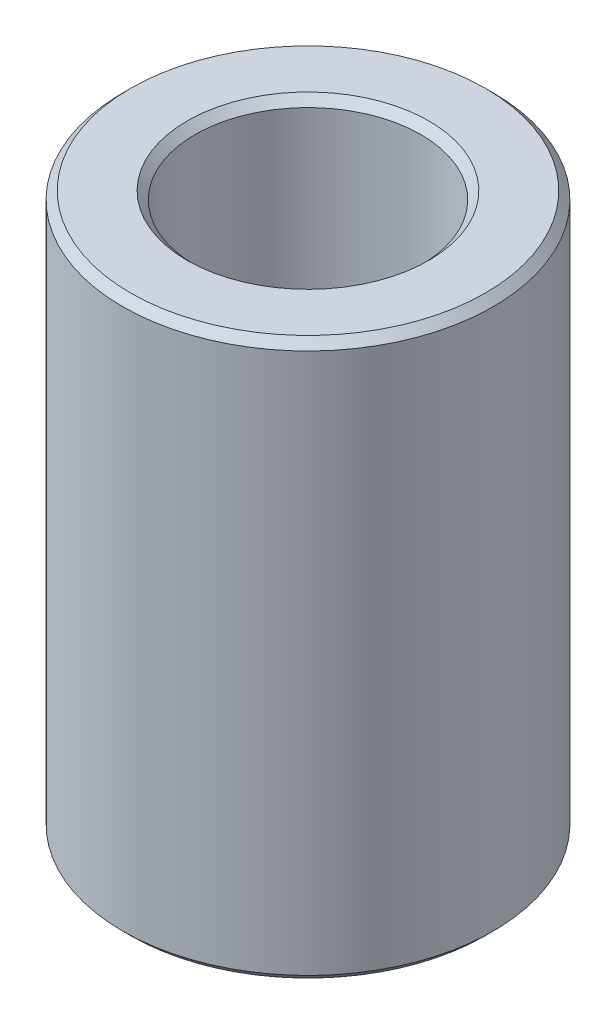
ISO-10303-21;
HEADER;
FILE_DESCRIPTION(('STEP AP214'),'2;1');
FILE_NAME('part.step','',(''),(''),'','','');
FILE_SCHEMA(('AUTOMOTIVE_DESIGN { 1 0 10303 214 1 1 1 1 }'));
ENDSEC;
DATA;
#1=APPLICATION_CONTEXT('core data for automotive mechanical design processes');
#2=APPLICATION_PROTOCOL_DEFINITION('international standard','automotive_design',2000,#1);
#3=PRODUCT_CONTEXT('',#1,'mechanical');
#4=PRODUCT('Part','Part','',(#3));
#5=PRODUCT_RELATED_PRODUCT_CATEGORY('part','',(#4));
#6=PRODUCT_DEFINITION_FORMATION('','',#4);
#7=PRODUCT_DEFINITION_CONTEXT('part definition',#1,'design');
#8=PRODUCT_DEFINITION('design','',#6,#7);
#9=PRODUCT_DEFINITION_SHAPE('','',#8);
#10=(LENGTH_UNIT() NAMED_UNIT(*) SI_UNIT(.MILLI.,.METRE.));
#11=(NAMED_UNIT(*) PLANE_ANGLE_UNIT() SI_UNIT($,.RADIAN.));
#12=(NAMED_UNIT(*) SI_UNIT($,.STERADIAN.) SOLID_ANGLE_UNIT());
#13=UNCERTAINTY_MEASURE_WITH_UNIT(LENGTH_MEASURE(1.E-05),#10,'distance_accuracy_value','');
#14=(GEOMETRIC_REPRESENTATION_CONTEXT(3) GLOBAL_UNCERTAINTY_ASSIGNED_CONTEXT((#13)) GLOBAL_UNIT_ASSIGNED_CONTEXT((#10,
#11,#12)) REPRESENTATION_CONTEXT('',''));
#15=CARTESIAN_POINT('',(0.,0.,0.));
#16=DIRECTION('',(0.,0.,1.));
#17=DIRECTION('',(1.,0.,0.));
#18=AXIS2_PLACEMENT_3D('',#15,#16,#17);
#19=CARTESIAN_POINT('',(0.,127.702674319287,0.));
#20=DIRECTION('',(0.,-1.,0.));
#21=DIRECTION('',(0.,0.,-1.));
#22=AXIS2_PLACEMENT_3D('',#19,#20,#21);
#23=CYLINDRICAL_SURFACE('',#22,42.5);
#24=CARTESIAN_POINT('',(0.,1.81172370269858,0.));
#25=DIRECTION('',(0.,1.,0.));
#26=DIRECTION('',(0.,0.,1.));
#27=AXIS2_PLACEMENT_3D('',#24,#25,#26);
#28=CIRCLE('',#27,42.5);
#29=CARTESIAN_POINT('',(0.,1.81172370269858,42.5));
#30=VERTEX_POINT('',#29);
#31=EDGE_CURVE('E10',#30,#30,#28,.T.);
#32=ORIENTED_EDGE('',*,*,#31,.T.);
#33=EDGE_LOOP('',(#32));
#34=FACE_BOUND('',#33,.T.);
#35=CARTESIAN_POINT('',(0.,125.890950616588,0.));
#36=DIRECTION('',(0.,1.,0.));
#37=DIRECTION('',(0.,0.,1.));
#38=AXIS2_PLACEMENT_3D('',#35,#36,#37);
#39=CIRCLE('',#38,42.5);
#40=CARTESIAN_POINT('',(0.,125.890950616588,42.5));
#41=VERTEX_POINT('',#40);
#42=EDGE_CURVE('E50',#41,#41,#39,.F.);
#43=ORIENTED_EDGE('',*,*,#42,.T.);
#44=EDGE_LOOP('',(#43));
#45=FACE_BOUND('',#44,.T.);
#46=ADVANCED_FACE('F39',(#34,#45),#23,.T.);
#47=CARTESIAN_POINT('',(0.,127.702674319287,0.));
#48=DIRECTION('',(0.,1.,0.));
#49=DIRECTION('',(0.,0.,1.));
#50=AXIS2_PLACEMENT_3D('',#47,#48,#49);
#51=PLANE('',#50);
#52=CARTESIAN_POINT('',(0.,127.702674319287,0.));
#53=DIRECTION('',(0.,1.,0.));
#54=DIRECTION('',(0.,0.,1.));
#55=AXIS2_PLACEMENT_3D('',#52,#53,#54);
#56=CIRCLE('',#55,27.7301246402489);
#57=CARTESIAN_POINT('',(0.,127.702674319287,27.7301246402489));
#58=VERTEX_POINT('',#57);
#59=EDGE_CURVE('E58',#58,#58,#56,.F.);
#60=ORIENTED_EDGE('',*,*,#59,.T.);
#61=EDGE_LOOP('',(#60));
#62=FACE_BOUND('',#61,.T.);
#63=CARTESIAN_POINT('',(0.,127.702674319287,0.));
#64=DIRECTION('',(0.,1.,0.));
#65=DIRECTION('',(0.,0.,1.));
#66=AXIS2_PLACEMENT_3D('',#63,#64,#65);
#67=CIRCLE('',#66,40.6882762973014);
#68=CARTESIAN_POINT('',(0.,127.702674319287,40.6882762973014));
#69=VERTEX_POINT('',#68);
#70=EDGE_CURVE('E61',#69,#69,#67,.T.);
#71=ORIENTED_EDGE('',*,*,#70,.T.);
#72=EDGE_LOOP('',(#71));
#73=FACE_BOUND('',#72,.T.);
#74=ADVANCED_FACE('F88',(#62,#73),#51,.T.);
#75=CARTESIAN_POINT('',(0.,0.,0.));
#76=DIRECTION('',(0.,1.,0.));
#77=DIRECTION('',(0.,0.,1.));
#78=AXIS2_PLACEMENT_3D('',#75,#76,#77);
#79=PLANE('',#78);
#80=CARTESIAN_POINT('',(0.,0.,0.));
#81=DIRECTION('',(0.,1.,0.));
#82=DIRECTION('',(0.,0.,1.));
#83=AXIS2_PLACEMENT_3D('',#80,#81,#82);
#84=CIRCLE('',#83,27.7301246402489);
#85=CARTESIAN_POINT('',(0.,0.,-27.7301246402489));
#86=VERTEX_POINT('',#85);
#87=EDGE_CURVE('E51',#86,#86,#84,.T.);
#88=ORIENTED_EDGE('',*,*,#87,.T.);
#89=EDGE_LOOP('',(#88));
#90=FACE_BOUND('',#89,.T.);
#91=CARTESIAN_POINT('',(0.,0.,0.));
#92=DIRECTION('',(0.,1.,0.));
#93=DIRECTION('',(0.,0.,1.));
#94=AXIS2_PLACEMENT_3D('',#91,#92,#93);
#95=CIRCLE('',#94,40.6882762973014);
#96=CARTESIAN_POINT('',(0.,0.,40.6882762973014));
#97=VERTEX_POINT('',#96);
#98=EDGE_CURVE('E54',#97,#97,#95,.F.);
#99=ORIENTED_EDGE('',*,*,#98,.T.);
#100=EDGE_LOOP('',(#99));
#101=FACE_BOUND('',#100,.T.);
#102=ADVANCED_FACE('F83',(#90,#101),#79,.F.);
#103=CARTESIAN_POINT('',(0.,127.702674319287,0.));
#104=DIRECTION('',(0.,-1.,0.));
#105=DIRECTION('',(0.,0.,-1.));
#106=AXIS2_PLACEMENT_3D('',#103,#104,#105);
#107=CYLINDRICAL_SURFACE('',#106,25.9184009375503);
#108=CARTESIAN_POINT('',(0.,125.890950616588,0.));
#109=DIRECTION('',(0.,1.,0.));
#110=DIRECTION('',(0.,0.,1.));
#111=AXIS2_PLACEMENT_3D('',#108,#109,#110);
#112=CIRCLE('',#111,25.9184009375503);
#113=CARTESIAN_POINT('',(0.,125.890950616588,-25.9184009375503));
#114=VERTEX_POINT('',#113);
#115=EDGE_CURVE('E67',#114,#114,#112,.T.);
#116=CARTESIAN_POINT('',(0.,1.81172370269861,0.));
#117=DIRECTION('',(0.,1.,0.));
#118=DIRECTION('',(0.,0.,1.));
#119=AXIS2_PLACEMENT_3D('',#116,#117,#118);
#120=CIRCLE('',#119,25.9184009375503);
#121=CARTESIAN_POINT('',(0.,1.81172370269858,-25.9184009375503));
#122=VERTEX_POINT('',#121);
#123=EDGE_CURVE('E69',#122,#122,#120,.F.);
#124=CARTESIAN_POINT('',(0.,125.890950616588,-25.9184009375503));
#125=CARTESIAN_POINT('',(0.,124.598458669569,-25.9184009375503));
#126=CARTESIAN_POINT('',(0.,123.305966722549,-25.9184009375503));
#127=CARTESIAN_POINT('',(0.,120.72098282851,-25.9184009375503));
#128=CARTESIAN_POINT('',(0.,119.42849088149,-25.9184009375503));
#129=CARTESIAN_POINT('',(0.,116.843506987451,-25.9184009375503));
#130=CARTESIAN_POINT('',(0.,115.551015040431,-25.9184009375503));
#131=CARTESIAN_POINT('',(0.,112.966031146392,-25.9184009375503));
#132=CARTESIAN_POINT('',(0.,111.673539199372,-25.9184009375503));
#133=CARTESIAN_POINT('',(0.,109.088555305333,-25.9184009375503));
#134=CARTESIAN_POINT('',(0.,107.796063358313,-25.9184009375503));
#135=CARTESIAN_POINT('',(0.,105.211079464273,-25.9184009375503));
#136=CARTESIAN_POINT('',(0.,103.918587517254,-25.9184009375503));
#137=CARTESIAN_POINT('',(0.,101.333603623214,-25.9184009375503));
#138=CARTESIAN_POINT('',(0.,100.041111676195,-25.9184009375503));
#139=CARTESIAN_POINT('',(0.,97.4561277821553,-25.9184009375503));
#140=CARTESIAN_POINT('',(0.,96.1636358351356,-25.9184009375503));
#141=CARTESIAN_POINT('',(0.,93.5786519410963,-25.9184009375503));
#142=CARTESIAN_POINT('',(0.,92.2861599940766,-25.9184009375503));
#143=CARTESIAN_POINT('',(0.,89.7011761000372,-25.9184009375503));
#144=CARTESIAN_POINT('',(0.,88.4086841530175,-25.9184009375503));
#145=CARTESIAN_POINT('',(0.,85.8237002589781,-25.9184009375503));
#146=CARTESIAN_POINT('',(0.,84.5312083119585,-25.9184009375503));
#147=CARTESIAN_POINT('',(0.,81.9462244179191,-25.9184009375503));
#148=CARTESIAN_POINT('',(0.,80.6537324708994,-25.9184009375503));
#149=CARTESIAN_POINT('',(0.,78.06874857686,-25.9184009375503));
#150=CARTESIAN_POINT('',(0.,76.7762566298403,-25.9184009375503));
#151=CARTESIAN_POINT('',(0.,74.191272735801,-25.9184009375503));
#152=CARTESIAN_POINT('',(0.,72.8987807887813,-25.9184009375503));
#153=CARTESIAN_POINT('',(0.,70.3137968947419,-25.9184009375503));
#154=CARTESIAN_POINT('',(0.,69.0213049477222,-25.9184009375503));
#155=CARTESIAN_POINT('',(0.,66.4363210536829,-25.9184009375503));
#156=CARTESIAN_POINT('',(0.,65.1438291066632,-25.9184009375503));
#157=CARTESIAN_POINT('',(0.,62.5588452126238,-25.9184009375503));
#158=CARTESIAN_POINT('',(0.,61.2663532656041,-25.9184009375503));
#159=CARTESIAN_POINT('',(0.,58.6813693715648,-25.9184009375503));
#160=CARTESIAN_POINT('',(0.,57.3888774245451,-25.9184009375503));
#161=CARTESIAN_POINT('',(0.,54.8038935305057,-25.9184009375503));
#162=CARTESIAN_POINT('',(0.,53.511401583486,-25.9184009375503));
#163=CARTESIAN_POINT('',(0.,50.9264176894466,-25.9184009375503));
#164=CARTESIAN_POINT('',(0.,49.633925742427,-25.9184009375503));
#165=CARTESIAN_POINT('',(0.,47.0489418483876,-25.9184009375503));
#166=CARTESIAN_POINT('',(0.,45.7564499013679,-25.9184009375503));
#167=CARTESIAN_POINT('',(0.,43.1714660073285,-25.9184009375503));
#168=CARTESIAN_POINT('',(0.,41.8789740603088,-25.9184009375503));
#169=CARTESIAN_POINT('',(0.,39.2939901662695,-25.9184009375503));
#170=CARTESIAN_POINT('',(0.,38.0014982192498,-25.9184009375503));
#171=CARTESIAN_POINT('',(0.,35.4165143252104,-25.9184009375503));
#172=CARTESIAN_POINT('',(0.,34.1240223781907,-25.9184009375503));
#173=CARTESIAN_POINT('',(0.,31.5390384841514,-25.9184009375503));
#174=CARTESIAN_POINT('',(0.,30.2465465371317,-25.9184009375503));
#175=CARTESIAN_POINT('',(0.,27.6615626430923,-25.9184009375503));
#176=CARTESIAN_POINT('',(0.,26.3690706960726,-25.9184009375503));
#177=CARTESIAN_POINT('',(0.,23.7840868020332,-25.9184009375503));
#178=CARTESIAN_POINT('',(0.,22.4915948550136,-25.9184009375503));
#179=CARTESIAN_POINT('',(0.,19.9066109609742,-25.9184009375503));
#180=CARTESIAN_POINT('',(0.,18.6141190139545,-25.9184009375503));
#181=CARTESIAN_POINT('',(0.,16.0291351199151,-25.9184009375503));
#182=CARTESIAN_POINT('',(0.,14.7366431728954,-25.9184009375503));
#183=CARTESIAN_POINT('',(0.,12.1516592788561,-25.9184009375503));
#184=CARTESIAN_POINT('',(0.,10.8591673318364,-25.9184009375503));
#185=CARTESIAN_POINT('',(0.,8.27418343779701,-25.9184009375503));
#186=CARTESIAN_POINT('',(0.,6.98169149077733,-25.9184009375503));
#187=CARTESIAN_POINT('',(0.,4.39670759673795,-25.9184009375503));
#188=CARTESIAN_POINT('',(0.,3.10421564971827,-25.9184009375503));
#189=CARTESIAN_POINT('',(0.,1.81172370269858,-25.9184009375503));
#190=B_SPLINE_CURVE_WITH_KNOTS('',3,(#124,#125,#126,#127,#128,#129,#130,#131,#132,#133,#134,
#135,#136,#137,#138,#139,#140,#141,#142,#143,#144,#145,#146,#147,#148,#149,#150,#151,#152,#153,
#154,#155,#156,#157,#158,#159,#160,#161,#162,#163,#164,#165,#166,#167,#168,#169,#170,#171,#172,
#173,#174,#175,#176,#177,#178,#179,#180,#181,#182,#183,#184,#185,#186,#187,#188,#189),
.UNSPECIFIED.,.F.,.F.,(4,2,2,2,2,2,2,2,2,2,2,2,2,2,2,2,2,2,2,2,2,2,2,2,2,2,2,2,2,2,2,2,4),(0.,
3.87747584105905,7.75495168211809,11.6324275231772,15.5099033642362,19.3873792052953,
23.2648550463543,27.1423308874134,31.0198067284724,34.8972825695315,38.7747584105906,
42.6522342516496,46.5297100927087,50.4071859337677,54.2846617748268,58.1621376158858,
62.0396134569449,65.917089298004,69.794565139063,73.6720409801221,77.5495168211811,
81.4269926622402,85.3044685032992,89.1819443443583,93.0594201854174,96.9368960264764,
100.814371867535,104.691847708595,108.569323549654,112.446799390713,116.324275231772,
120.201751072831,124.07922691389),.UNSPECIFIED.);
#191=EDGE_CURVE('BSEAM71',#114,#122,#190,.T.);
#192=ORIENTED_EDGE('',*,*,#115,.T.);
#193=ORIENTED_EDGE('',*,*,#123,.T.);
#194=ORIENTED_EDGE('',*,*,#191,.T.);
#195=ORIENTED_EDGE('',*,*,#191,.F.);
#196=EDGE_LOOP('',(#192,#194,#193,#195));
#197=FACE_BOUND('',#196,.T.);
#198=ADVANCED_FACE('F71',(#197),#107,.F.);
#199=CARTESIAN_POINT('',(0.,125.890950616588,0.));
#200=DIRECTION('',(0.,1.,0.));
#201=DIRECTION('',(0.,0.,1.));
#202=AXIS2_PLACEMENT_3D('',#199,#200,#201);
#203=CONICAL_SURFACE('',#202,25.9184009375503,0.785398163397446);
#204=ORIENTED_EDGE('',*,*,#59,.F.);
#205=EDGE_LOOP('',(#204));
#206=FACE_BOUND('',#205,.T.);
#207=ORIENTED_EDGE('',*,*,#115,.F.);
#208=EDGE_LOOP('',(#207));
#209=FACE_BOUND('',#208,.T.);
#210=ADVANCED_FACE('F77',(#206,#209),#203,.F.);
#211=CARTESIAN_POINT('',(0.,0.,0.));
#212=DIRECTION('',(0.,-1.,0.));
#213=DIRECTION('',(0.,0.,-1.));
#214=AXIS2_PLACEMENT_3D('',#211,#212,#213);
#215=CONICAL_SURFACE('',#214,27.7301246402489,0.785398163397443);
#216=CARTESIAN_POINT('',(0.,1.81172370269861,-25.9184009375503));
#217=CARTESIAN_POINT('',(0.,1.7928515807955,-25.9372730594534));
#218=CARTESIAN_POINT('',(0.,1.77397945889239,-25.9561451813566));
#219=CARTESIAN_POINT('',(0.,1.73623521508617,-25.9938894251628));
#220=CARTESIAN_POINT('',(0.,1.71736309318306,-26.0127615470659));
#221=CARTESIAN_POINT('',(0.,1.67961884937684,-26.0505057908721));
#222=CARTESIAN_POINT('',(0.,1.66074672747372,-26.0693779127752));
#223=CARTESIAN_POINT('',(0.,1.6230024836675,-26.1071221565814));
#224=CARTESIAN_POINT('',(0.,1.60413036176439,-26.1259942784845));
#225=CARTESIAN_POINT('',(0.,1.56638611795817,-26.1637385222908));
#226=CARTESIAN_POINT('',(0.,1.54751399605506,-26.1826106441939));
#227=CARTESIAN_POINT('',(0.,1.50976975224884,-26.2203548880001));
#228=CARTESIAN_POINT('',(0.,1.49089763034573,-26.2392270099032));
#229=CARTESIAN_POINT('',(0.,1.45315338653951,-26.2769712537094));
#230=CARTESIAN_POINT('',(0.,1.4342812646364,-26.2958433756125));
#231=CARTESIAN_POINT('',(0.,1.39653702083018,-26.3335876194188));
#232=CARTESIAN_POINT('',(0.,1.37766489892707,-26.3524597413219));
#233=CARTESIAN_POINT('',(0.,1.33992065512085,-26.3902039851281));
#234=CARTESIAN_POINT('',(0.,1.32104853321774,-26.4090761070312));
#235=CARTESIAN_POINT('',(0.,1.28330428941151,-26.4468203508374));
#236=CARTESIAN_POINT('',(0.,1.2644321675084,-26.4656924727405));
#237=CARTESIAN_POINT('',(0.,1.22668792370218,-26.5034367165467));
#238=CARTESIAN_POINT('',(0.,1.20781580179907,-26.5223088384499));
#239=CARTESIAN_POINT('',(0.,1.17007155799285,-26.5600530822561));
#240=CARTESIAN_POINT('',(0.,1.15119943608974,-26.5789252041592));
#241=CARTESIAN_POINT('',(0.,1.11345519228352,-26.6166694479654));
#242=CARTESIAN_POINT('',(0.,1.09458307038041,-26.6355415698685));
#243=CARTESIAN_POINT('',(0.,1.05683882657419,-26.6732858136747));
#244=CARTESIAN_POINT('',(0.,1.03796670467108,-26.6921579355779));
#245=CARTESIAN_POINT('',(0.,1.00022246086486,-26.7299021793841));
#246=CARTESIAN_POINT('',(0.,0.981350338961746,-26.7487743012872));
#247=CARTESIAN_POINT('',(0.,0.943606095155526,-26.7865185450934));
#248=CARTESIAN_POINT('',(0.,0.924733973252415,-26.8053906669965));
#249=CARTESIAN_POINT('',(0.,0.886989729446194,-26.8431349108027));
#250=CARTESIAN_POINT('',(0.,0.868117607543083,-26.8620070327058));
#251=CARTESIAN_POINT('',(0.,0.830373363736862,-26.8997512765121));
#252=CARTESIAN_POINT('',(0.,0.811501241833752,-26.9186233984152));
#253=CARTESIAN_POINT('',(0.,0.773756998027531,-26.9563676422214));
#254=CARTESIAN_POINT('',(0.,0.75488487612442,-26.9752397641245));
#255=CARTESIAN_POINT('',(0.,0.717140632318199,-27.0129840079307));
#256=CARTESIAN_POINT('',(0.,0.698268510415088,-27.0318561298338));
#257=CARTESIAN_POINT('',(0.,0.660524266608867,-27.0696003736401));
#258=CARTESIAN_POINT('',(0.,0.641652144705757,-27.0884724955432));
#259=CARTESIAN_POINT('',(0.,0.603907900899537,-27.1262167393494));
#260=CARTESIAN_POINT('',(0.,0.585035778996426,-27.1450888612525));
#261=CARTESIAN_POINT('',(0.,0.547291535190204,-27.1828331050587));
#262=CARTESIAN_POINT('',(0.,0.528419413287094,-27.2017052269618));
#263=CARTESIAN_POINT('',(0.,0.490675169480873,-27.2394494707681));
#264=CARTESIAN_POINT('',(0.,0.471803047577763,-27.2583215926712));
#265=CARTESIAN_POINT('',(0.,0.434058803771542,-27.2960658364774));
#266=CARTESIAN_POINT('',(0.,0.415186681868431,-27.3149379583805));
#267=CARTESIAN_POINT('',(0.,0.37744243806221,-27.3526822021867));
#268=CARTESIAN_POINT('',(0.,0.3585703161591,-27.3715543240898));
#269=CARTESIAN_POINT('',(0.,0.320826072352879,-27.409298567896));
#270=CARTESIAN_POINT('',(0.,0.301953950449768,-27.4281706897992));
#271=CARTESIAN_POINT('',(0.,0.264209706643547,-27.4659149336054));
#272=CARTESIAN_POINT('',(0.,0.245337584740437,-27.4847870555085));
#273=CARTESIAN_POINT('',(0.,0.207593340934216,-27.5225312993147));
#274=CARTESIAN_POINT('',(0.,0.188721219031105,-27.5414034212178));
#275=CARTESIAN_POINT('',(0.,0.150976975224884,-27.579147665024));
#276=CARTESIAN_POINT('',(0.,0.132104853321773,-27.5980197869271));
#277=CARTESIAN_POINT('',(0.,0.0943606095155523,-27.6357640307334));
#278=CARTESIAN_POINT('',(0.,0.075488487612442,-27.6546361526365));
#279=CARTESIAN_POINT('',(0.,0.0377442438062216,-27.6923803964427));
#280=CARTESIAN_POINT('',(0.,0.0188721219031113,-27.7112525183458));
#281=CARTESIAN_POINT('',(0.,0.,-27.7301246402489));
#282=B_SPLINE_CURVE_WITH_KNOTS('',3,(#216,#217,#218,#219,#220,#221,#222,#223,#224,#225,#226,
#227,#228,#229,#230,#231,#232,#233,#234,#235,#236,#237,#238,#239,#240,#241,#242,#243,#244,#245,
#246,#247,#248,#249,#250,#251,#252,#253,#254,#255,#256,#257,#258,#259,#260,#261,#262,#263,#264,
#265,#266,#267,#268,#269,#270,#271,#272,#273,#274,#275,#276,#277,#278,#279,#280,#281),
.UNSPECIFIED.,.F.,.F.,(4,2,2,2,2,2,2,2,2,2,2,2,2,2,2,2,2,2,2,2,2,2,2,2,2,2,2,2,2,2,2,2,4),(0.,
0.0800676322384105,0.160135264476823,0.240202896715234,0.320270528953644,0.400338161192057,
0.480405793430468,0.560473425668878,0.640541057907289,0.720608690145701,0.800676322384112,
0.880743954622522,0.960811586860935,1.04087921909935,1.12094685133776,1.20101448357617,
1.28108211581458,1.36114974805299,1.4412173802914,1.52128501252981,1.60135264476822,
1.68142027700664,1.76148790924505,1.84155554148346,1.92162317372187,2.00169080596028,
2.08175843819869,2.1618260704371,2.24189370267551,2.32196133491393,2.40202896715234,
2.48209659939075,2.56216423162916),.UNSPECIFIED.);
#283=EDGE_CURVE('BSEAM73',#122,#86,#282,.T.);
#284=ORIENTED_EDGE('',*,*,#123,.F.);
#285=ORIENTED_EDGE('',*,*,#87,.F.);
#286=ORIENTED_EDGE('',*,*,#283,.T.);
#287=ORIENTED_EDGE('',*,*,#283,.F.);
#288=EDGE_LOOP('',(#284,#286,#285,#287));
#289=FACE_BOUND('',#288,.T.);
#290=ADVANCED_FACE('F73',(#289),#215,.F.);
#291=CARTESIAN_POINT('',(0.,1.81172370269858,0.));
#292=DIRECTION('',(0.,1.,0.));
#293=DIRECTION('',(0.,0.,1.));
#294=AXIS2_PLACEMENT_3D('',#291,#292,#293);
#295=CONICAL_SURFACE('',#294,42.5,0.785398163397456);
#296=ORIENTED_EDGE('',*,*,#98,.F.);
#297=EDGE_LOOP('',(#296));
#298=FACE_BOUND('',#297,.T.);
#299=ORIENTED_EDGE('',*,*,#31,.F.);
#300=EDGE_LOOP('',(#299));
#301=FACE_BOUND('',#300,.T.);
#302=ADVANCED_FACE('F76',(#298,#301),#295,.T.);
#303=CARTESIAN_POINT('',(0.,127.702674319287,0.));
#304=DIRECTION('',(0.,-1.,0.));
#305=DIRECTION('',(0.,0.,-1.));
#306=AXIS2_PLACEMENT_3D('',#303,#304,#305);
#307=CONICAL_SURFACE('',#306,40.6882762973014,0.785398163397456);
#308=ORIENTED_EDGE('',*,*,#42,.F.);
#309=EDGE_LOOP('',(#308));
#310=FACE_BOUND('',#309,.T.);
#311=ORIENTED_EDGE('',*,*,#70,.F.);
#312=EDGE_LOOP('',(#311));
#313=FACE_BOUND('',#312,.T.);
#314=ADVANCED_FACE('F45',(#310,#313),#307,.T.);
#315=CLOSED_SHELL('',(#46,#74,#102,#198,#210,#290,#302,#314));
#316=MANIFOLD_SOLID_BREP('B2',#315);
#317=ADVANCED_BREP_SHAPE_REPRESENTATION('',(#18,#316),#14);
#318=SHAPE_DEFINITION_REPRESENTATION(#9,#317);
ENDSEC;
END-ISO-10303-21;
